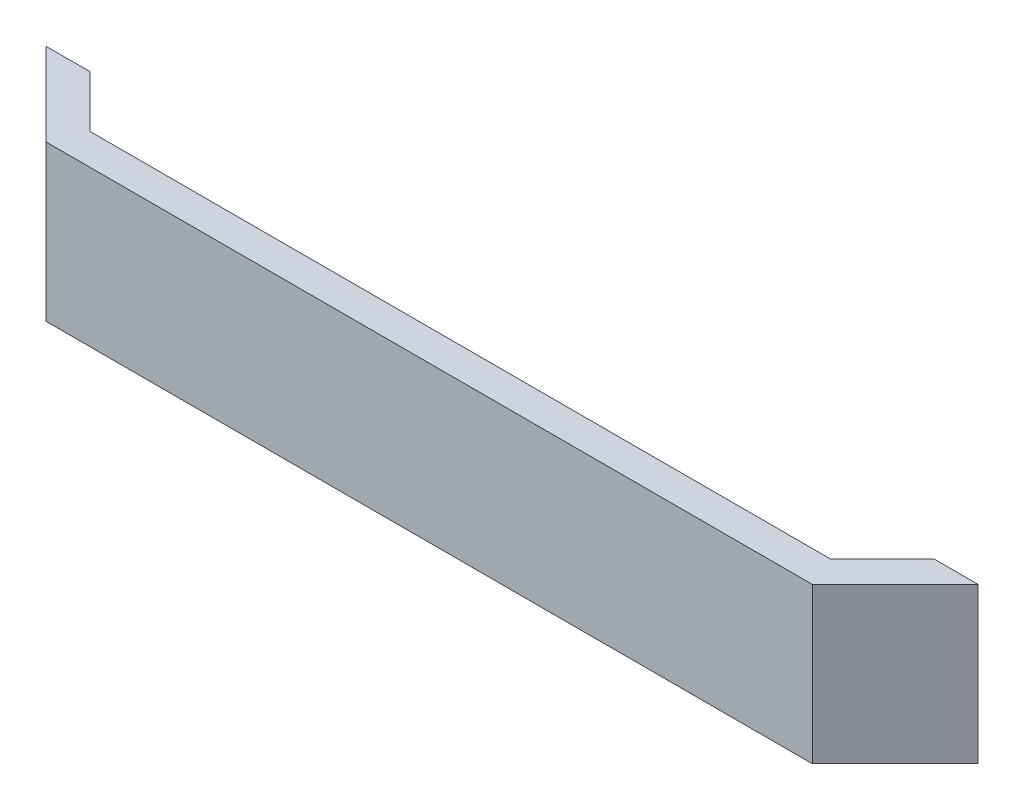
ISO-10303-21;
HEADER;
FILE_DESCRIPTION(('STEP AP214'),'2;1');
FILE_NAME('part.step','',(''),(''),'','','');
FILE_SCHEMA(('AUTOMOTIVE_DESIGN { 1 0 10303 214 1 1 1 1 }'));
ENDSEC;
DATA;
#1=APPLICATION_CONTEXT('core data for automotive mechanical design processes');
#2=APPLICATION_PROTOCOL_DEFINITION('international standard','automotive_design',2000,#1);
#3=PRODUCT_CONTEXT('',#1,'mechanical');
#4=PRODUCT('Part','Part','',(#3));
#5=PRODUCT_RELATED_PRODUCT_CATEGORY('part','',(#4));
#6=PRODUCT_DEFINITION_FORMATION('','',#4);
#7=PRODUCT_DEFINITION_CONTEXT('part definition',#1,'design');
#8=PRODUCT_DEFINITION('design','',#6,#7);
#9=PRODUCT_DEFINITION_SHAPE('','',#8);
#10=(LENGTH_UNIT() NAMED_UNIT(*) SI_UNIT(.MILLI.,.METRE.));
#11=(NAMED_UNIT(*) PLANE_ANGLE_UNIT() SI_UNIT($,.RADIAN.));
#12=(NAMED_UNIT(*) SI_UNIT($,.STERADIAN.) SOLID_ANGLE_UNIT());
#13=UNCERTAINTY_MEASURE_WITH_UNIT(LENGTH_MEASURE(1.E-05),#10,'distance_accuracy_value','');
#14=(GEOMETRIC_REPRESENTATION_CONTEXT(3) GLOBAL_UNCERTAINTY_ASSIGNED_CONTEXT((#13)) GLOBAL_UNIT_ASSIGNED_CONTEXT((#10,
#11,#12)) REPRESENTATION_CONTEXT('',''));
#15=CARTESIAN_POINT('',(0.,0.,0.));
#16=DIRECTION('',(0.,0.,1.));
#17=DIRECTION('',(1.,0.,0.));
#18=AXIS2_PLACEMENT_3D('',#15,#16,#17);
#19=CARTESIAN_POINT('',(-35.7573593128807,15.,-3.));
#20=DIRECTION('',(0.,0.,1.));
#21=DIRECTION('',(1.,0.,0.));
#22=AXIS2_PLACEMENT_3D('',#19,#20,#21);
#23=PLANE('',#22);
#24=DIRECTION('',(-1.,0.,0.));
#25=VECTOR('',#24,1.);
#26=CARTESIAN_POINT('',(-35.7573593128807,0.,-3.));
#27=LINE('',#26,#25);
#28=CARTESIAN_POINT('',(35.7573593128807,0.,-3.));
#29=VERTEX_POINT('',#28);
#30=CARTESIAN_POINT('',(-35.7573593128807,0.,-3.));
#31=VERTEX_POINT('',#30);
#32=EDGE_CURVE('E140',#29,#31,#27,.T.);
#33=ORIENTED_EDGE('',*,*,#32,.T.);
#34=DIRECTION('',(0.,-1.,0.));
#35=VECTOR('',#34,1.);
#36=CARTESIAN_POINT('',(-35.7573593128807,15.,-3.));
#37=LINE('',#36,#35);
#38=CARTESIAN_POINT('',(-35.7573593128807,15.,-3.));
#39=VERTEX_POINT('',#38);
#40=EDGE_CURVE('E11',#39,#31,#37,.T.);
#41=ORIENTED_EDGE('',*,*,#40,.F.);
#42=DIRECTION('',(-1.,0.,0.));
#43=VECTOR('',#42,1.);
#44=CARTESIAN_POINT('',(-35.7573593128807,15.,-3.));
#45=LINE('',#44,#43);
#46=CARTESIAN_POINT('',(35.7573593128807,15.,-3.));
#47=VERTEX_POINT('',#46);
#48=EDGE_CURVE('E162',#47,#39,#45,.T.);
#49=ORIENTED_EDGE('',*,*,#48,.F.);
#50=DIRECTION('',(0.,-1.,0.));
#51=VECTOR('',#50,1.);
#52=CARTESIAN_POINT('',(35.7573593128807,15.,-3.));
#53=LINE('',#52,#51);
#54=EDGE_CURVE('E136',#47,#29,#53,.T.);
#55=ORIENTED_EDGE('',*,*,#54,.T.);
#56=EDGE_LOOP('',(#33,#41,#49,#55));
#57=FACE_BOUND('',#56,.T.);
#58=ADVANCED_FACE('F39',(#57),#23,.F.);
#59=CARTESIAN_POINT('',(-35.7573593128807,15.,-3.));
#60=DIRECTION('',(-0.707106781186543,0.,0.707106781186552));
#61=DIRECTION('',(0.707106781186552,0.,0.707106781186543));
#62=AXIS2_PLACEMENT_3D('',#59,#60,#61);
#63=PLANE('',#62);
#64=DIRECTION('',(-0.707106781186552,0.,-0.707106781186543));
#65=VECTOR('',#64,1.);
#66=CARTESIAN_POINT('',(-35.7573593128807,0.,-3.));
#67=LINE('',#66,#65);
#68=CARTESIAN_POINT('',(-40.7573593128808,0.,-8.));
#69=VERTEX_POINT('',#68);
#70=EDGE_CURVE('E144',#31,#69,#67,.T.);
#71=ORIENTED_EDGE('',*,*,#70,.T.);
#72=DIRECTION('',(0.,-1.,0.));
#73=VECTOR('',#72,1.);
#74=CARTESIAN_POINT('',(-40.7573593128808,15.,-8.));
#75=LINE('',#74,#73);
#76=CARTESIAN_POINT('',(-40.7573593128808,15.,-8.));
#77=VERTEX_POINT('',#76);
#78=EDGE_CURVE('E48',#77,#69,#75,.T.);
#79=ORIENTED_EDGE('',*,*,#78,.F.);
#80=DIRECTION('',(-0.707106781186552,0.,-0.707106781186543));
#81=VECTOR('',#80,1.);
#82=CARTESIAN_POINT('',(-35.7573593128807,15.,-3.));
#83=LINE('',#82,#81);
#84=EDGE_CURVE('E99',#39,#77,#83,.T.);
#85=ORIENTED_EDGE('',*,*,#84,.F.);
#86=ORIENTED_EDGE('',*,*,#40,.T.);
#87=EDGE_LOOP('',(#71,#79,#85,#86));
#88=FACE_BOUND('',#87,.T.);
#89=ADVANCED_FACE('F208',(#88),#63,.F.);
#90=CARTESIAN_POINT('',(-45.0000000000001,15.,-8.));
#91=DIRECTION('',(0.,0.,1.));
#92=DIRECTION('',(1.,0.,0.));
#93=AXIS2_PLACEMENT_3D('',#90,#91,#92);
#94=PLANE('',#93);
#95=DIRECTION('',(-1.,0.,0.));
#96=VECTOR('',#95,1.);
#97=CARTESIAN_POINT('',(-45.0000000000001,0.,-8.));
#98=LINE('',#97,#96);
#99=CARTESIAN_POINT('',(-45.0000000000001,0.,-8.));
#100=VERTEX_POINT('',#99);
#101=EDGE_CURVE('E147',#69,#100,#98,.T.);
#102=ORIENTED_EDGE('',*,*,#101,.T.);
#103=DIRECTION('',(0.,-1.,0.));
#104=VECTOR('',#103,1.);
#105=CARTESIAN_POINT('',(-45.0000000000001,15.,-8.));
#106=LINE('',#105,#104);
#107=CARTESIAN_POINT('',(-45.0000000000001,15.,-8.));
#108=VERTEX_POINT('',#107);
#109=EDGE_CURVE('E173',#108,#100,#106,.T.);
#110=ORIENTED_EDGE('',*,*,#109,.F.);
#111=DIRECTION('',(-1.,0.,0.));
#112=VECTOR('',#111,1.);
#113=CARTESIAN_POINT('',(-45.0000000000001,15.,-8.));
#114=LINE('',#113,#112);
#115=EDGE_CURVE('E183',#77,#108,#114,.T.);
#116=ORIENTED_EDGE('',*,*,#115,.F.);
#117=ORIENTED_EDGE('',*,*,#78,.T.);
#118=EDGE_LOOP('',(#102,#110,#116,#117));
#119=FACE_BOUND('',#118,.T.);
#120=ADVANCED_FACE('F181',(#119),#94,.F.);
#121=CARTESIAN_POINT('',(-37.,15.,0.));
#122=DIRECTION('',(0.707106781186544,0.,-0.707106781186552));
#123=DIRECTION('',(-0.707106781186552,0.,-0.707106781186544));
#124=AXIS2_PLACEMENT_3D('',#121,#122,#123);
#125=PLANE('',#124);
#126=DIRECTION('',(0.707106781186552,0.,0.707106781186544));
#127=VECTOR('',#126,1.);
#128=CARTESIAN_POINT('',(-37.,0.,0.));
#129=LINE('',#128,#127);
#130=CARTESIAN_POINT('',(-37.,0.,0.));
#131=VERTEX_POINT('',#130);
#132=EDGE_CURVE('E150',#100,#131,#129,.T.);
#133=ORIENTED_EDGE('',*,*,#132,.T.);
#134=DIRECTION('',(0.,-1.,0.));
#135=VECTOR('',#134,1.);
#136=CARTESIAN_POINT('',(-37.,15.,0.));
#137=LINE('',#136,#135);
#138=CARTESIAN_POINT('',(-37.,15.,0.));
#139=VERTEX_POINT('',#138);
#140=EDGE_CURVE('E169',#139,#131,#137,.T.);
#141=ORIENTED_EDGE('',*,*,#140,.F.);
#142=DIRECTION('',(0.707106781186552,0.,0.707106781186544));
#143=VECTOR('',#142,1.);
#144=CARTESIAN_POINT('',(-37.,15.,0.));
#145=LINE('',#144,#143);
#146=EDGE_CURVE('E196',#108,#139,#145,.T.);
#147=ORIENTED_EDGE('',*,*,#146,.F.);
#148=ORIENTED_EDGE('',*,*,#109,.T.);
#149=EDGE_LOOP('',(#133,#141,#147,#148));
#150=FACE_BOUND('',#149,.T.);
#151=ADVANCED_FACE('F191',(#150),#125,.F.);
#152=CARTESIAN_POINT('',(-37.,15.,0.));
#153=DIRECTION('',(0.,0.,-1.));
#154=DIRECTION('',(-1.,0.,0.));
#155=AXIS2_PLACEMENT_3D('',#152,#153,#154);
#156=PLANE('',#155);
#157=DIRECTION('',(1.,0.,0.));
#158=VECTOR('',#157,1.);
#159=CARTESIAN_POINT('',(-37.,0.,0.));
#160=LINE('',#159,#158);
#161=CARTESIAN_POINT('',(37.,0.,0.));
#162=VERTEX_POINT('',#161);
#163=EDGE_CURVE('E153',#131,#162,#160,.T.);
#164=ORIENTED_EDGE('',*,*,#163,.T.);
#165=DIRECTION('',(0.,-1.,0.));
#166=VECTOR('',#165,1.);
#167=CARTESIAN_POINT('',(37.,15.,0.));
#168=LINE('',#167,#166);
#169=CARTESIAN_POINT('',(37.,15.,0.));
#170=VERTEX_POINT('',#169);
#171=EDGE_CURVE('E129',#170,#162,#168,.T.);
#172=ORIENTED_EDGE('',*,*,#171,.F.);
#173=DIRECTION('',(1.,0.,0.));
#174=VECTOR('',#173,1.);
#175=CARTESIAN_POINT('',(-37.,15.,0.));
#176=LINE('',#175,#174);
#177=EDGE_CURVE('E118',#139,#170,#176,.T.);
#178=ORIENTED_EDGE('',*,*,#177,.F.);
#179=ORIENTED_EDGE('',*,*,#140,.T.);
#180=EDGE_LOOP('',(#164,#172,#178,#179));
#181=FACE_BOUND('',#180,.T.);
#182=ADVANCED_FACE('F194',(#181),#156,.F.);
#183=CARTESIAN_POINT('',(37.,15.,0.));
#184=DIRECTION('',(-0.707106781186549,0.,-0.707106781186546));
#185=DIRECTION('',(-0.707106781186546,0.,0.707106781186549));
#186=AXIS2_PLACEMENT_3D('',#183,#184,#185);
#187=PLANE('',#186);
#188=DIRECTION('',(0.707106781186546,0.,-0.707106781186549));
#189=VECTOR('',#188,1.);
#190=CARTESIAN_POINT('',(37.,0.,0.));
#191=LINE('',#190,#189);
#192=CARTESIAN_POINT('',(45.,0.,-8.));
#193=VERTEX_POINT('',#192);
#194=EDGE_CURVE('E127',#162,#193,#191,.T.);
#195=ORIENTED_EDGE('',*,*,#194,.T.);
#196=DIRECTION('',(0.,-1.,0.));
#197=VECTOR('',#196,1.);
#198=CARTESIAN_POINT('',(45.,15.,-8.));
#199=LINE('',#198,#197);
#200=CARTESIAN_POINT('',(45.,15.,-8.));
#201=VERTEX_POINT('',#200);
#202=EDGE_CURVE('E124',#201,#193,#199,.T.);
#203=ORIENTED_EDGE('',*,*,#202,.F.);
#204=DIRECTION('',(0.707106781186546,0.,-0.707106781186549));
#205=VECTOR('',#204,1.);
#206=CARTESIAN_POINT('',(37.,15.,0.));
#207=LINE('',#206,#205);
#208=EDGE_CURVE('E112',#170,#201,#207,.T.);
#209=ORIENTED_EDGE('',*,*,#208,.F.);
#210=ORIENTED_EDGE('',*,*,#171,.T.);
#211=EDGE_LOOP('',(#195,#203,#209,#210));
#212=FACE_BOUND('',#211,.T.);
#213=ADVANCED_FACE('F125',(#212),#187,.F.);
#214=CARTESIAN_POINT('',(40.7573593128807,15.,-8.));
#215=DIRECTION('',(0.,0.,1.));
#216=DIRECTION('',(1.,0.,0.));
#217=AXIS2_PLACEMENT_3D('',#214,#215,#216);
#218=PLANE('',#217);
#219=DIRECTION('',(-1.,0.,0.));
#220=VECTOR('',#219,1.);
#221=CARTESIAN_POINT('',(40.7573593128807,0.,-8.));
#222=LINE('',#221,#220);
#223=CARTESIAN_POINT('',(40.7573593128807,0.,-8.));
#224=VERTEX_POINT('',#223);
#225=EDGE_CURVE('E85',#193,#224,#222,.T.);
#226=ORIENTED_EDGE('',*,*,#225,.T.);
#227=DIRECTION('',(0.,-1.,0.));
#228=VECTOR('',#227,1.);
#229=CARTESIAN_POINT('',(40.7573593128807,15.,-8.));
#230=LINE('',#229,#228);
#231=CARTESIAN_POINT('',(40.7573593128807,15.,-8.));
#232=VERTEX_POINT('',#231);
#233=EDGE_CURVE('E130',#232,#224,#230,.T.);
#234=ORIENTED_EDGE('',*,*,#233,.F.);
#235=DIRECTION('',(-1.,0.,0.));
#236=VECTOR('',#235,1.);
#237=CARTESIAN_POINT('',(40.7573593128807,15.,-8.));
#238=LINE('',#237,#236);
#239=EDGE_CURVE('E116',#201,#232,#238,.T.);
#240=ORIENTED_EDGE('',*,*,#239,.F.);
#241=ORIENTED_EDGE('',*,*,#202,.T.);
#242=EDGE_LOOP('',(#226,#234,#240,#241));
#243=FACE_BOUND('',#242,.T.);
#244=ADVANCED_FACE('F132',(#243),#218,.F.);
#245=CARTESIAN_POINT('',(35.7573593128807,15.,-3.));
#246=DIRECTION('',(0.707106781186549,0.,0.707106781186546));
#247=DIRECTION('',(0.707106781186546,0.,-0.707106781186549));
#248=AXIS2_PLACEMENT_3D('',#245,#246,#247);
#249=PLANE('',#248);
#250=DIRECTION('',(-0.707106781186546,0.,0.707106781186549));
#251=VECTOR('',#250,1.);
#252=CARTESIAN_POINT('',(35.7573593128807,0.,-3.));
#253=LINE('',#252,#251);
#254=EDGE_CURVE('E91',#224,#29,#253,.T.);
#255=ORIENTED_EDGE('',*,*,#254,.T.);
#256=ORIENTED_EDGE('',*,*,#54,.F.);
#257=DIRECTION('',(-0.707106781186546,0.,0.707106781186549));
#258=VECTOR('',#257,1.);
#259=CARTESIAN_POINT('',(35.7573593128807,15.,-3.));
#260=LINE('',#259,#258);
#261=EDGE_CURVE('E56',#232,#47,#260,.T.);
#262=ORIENTED_EDGE('',*,*,#261,.F.);
#263=ORIENTED_EDGE('',*,*,#233,.T.);
#264=EDGE_LOOP('',(#255,#256,#262,#263));
#265=FACE_BOUND('',#264,.T.);
#266=ADVANCED_FACE('F224',(#265),#249,.F.);
#267=CARTESIAN_POINT('',(0.,15.,0.));
#268=DIRECTION('',(0.,1.,0.));
#269=DIRECTION('',(0.,0.,1.));
#270=AXIS2_PLACEMENT_3D('',#267,#268,#269);
#271=PLANE('',#270);
#272=ORIENTED_EDGE('',*,*,#48,.T.);
#273=ORIENTED_EDGE('',*,*,#84,.T.);
#274=ORIENTED_EDGE('',*,*,#115,.T.);
#275=ORIENTED_EDGE('',*,*,#146,.T.);
#276=ORIENTED_EDGE('',*,*,#177,.T.);
#277=ORIENTED_EDGE('',*,*,#208,.T.);
#278=ORIENTED_EDGE('',*,*,#239,.T.);
#279=ORIENTED_EDGE('',*,*,#261,.T.);
#280=EDGE_LOOP('',(#272,#273,#274,#275,#276,#277,#278,#279));
#281=FACE_BOUND('',#280,.T.);
#282=ADVANCED_FACE('F114',(#281),#271,.T.);
#283=CARTESIAN_POINT('',(0.,0.,0.));
#284=DIRECTION('',(0.,1.,0.));
#285=DIRECTION('',(0.,0.,1.));
#286=AXIS2_PLACEMENT_3D('',#283,#284,#285);
#287=PLANE('',#286);
#288=ORIENTED_EDGE('',*,*,#32,.F.);
#289=ORIENTED_EDGE('',*,*,#254,.F.);
#290=ORIENTED_EDGE('',*,*,#225,.F.);
#291=ORIENTED_EDGE('',*,*,#194,.F.);
#292=ORIENTED_EDGE('',*,*,#163,.F.);
#293=ORIENTED_EDGE('',*,*,#132,.F.);
#294=ORIENTED_EDGE('',*,*,#101,.F.);
#295=ORIENTED_EDGE('',*,*,#70,.F.);
#296=EDGE_LOOP('',(#288,#289,#290,#291,#292,#293,#294,#295));
#297=FACE_BOUND('',#296,.T.);
#298=ADVANCED_FACE('F187',(#297),#287,.F.);
#299=CLOSED_SHELL('',(#58,#89,#120,#151,#182,#213,#244,#266,#282,#298));
#300=MANIFOLD_SOLID_BREP('B2',#299);
#301=ADVANCED_BREP_SHAPE_REPRESENTATION('',(#18,#300),#14);
#302=SHAPE_DEFINITION_REPRESENTATION(#9,#301);
ENDSEC;
END-ISO-10303-21;
